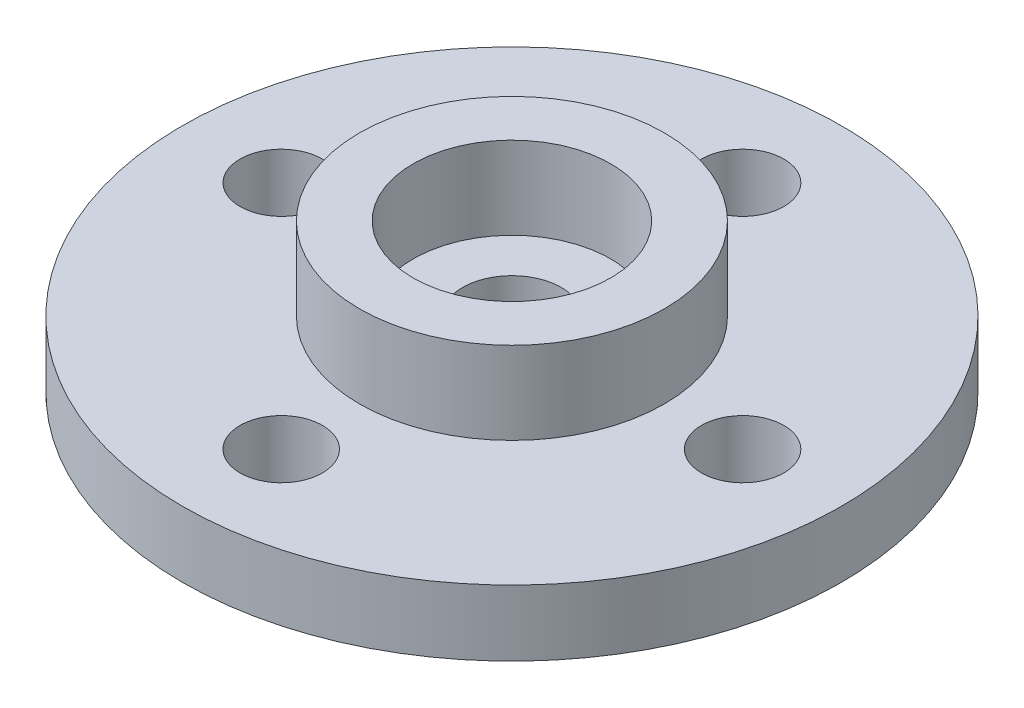
ISO-10303-21;
HEADER;
FILE_DESCRIPTION(('STEP AP214'),'2;1');
FILE_NAME('part.step','',(''),(''),'','','');
FILE_SCHEMA(('AUTOMOTIVE_DESIGN { 1 0 10303 214 1 1 1 1 }'));
ENDSEC;
DATA;
#1=APPLICATION_CONTEXT('core data for automotive mechanical design processes');
#2=APPLICATION_PROTOCOL_DEFINITION('international standard','automotive_design',2000,#1);
#3=PRODUCT_CONTEXT('',#1,'mechanical');
#4=PRODUCT('Part','Part','',(#3));
#5=PRODUCT_RELATED_PRODUCT_CATEGORY('part','',(#4));
#6=PRODUCT_DEFINITION_FORMATION('','',#4);
#7=PRODUCT_DEFINITION_CONTEXT('part definition',#1,'design');
#8=PRODUCT_DEFINITION('design','',#6,#7);
#9=PRODUCT_DEFINITION_SHAPE('','',#8);
#10=(LENGTH_UNIT() NAMED_UNIT(*) SI_UNIT(.MILLI.,.METRE.));
#11=(NAMED_UNIT(*) PLANE_ANGLE_UNIT() SI_UNIT($,.RADIAN.));
#12=(NAMED_UNIT(*) SI_UNIT($,.STERADIAN.) SOLID_ANGLE_UNIT());
#13=UNCERTAINTY_MEASURE_WITH_UNIT(LENGTH_MEASURE(1.E-05),#10,'distance_accuracy_value','');
#14=(GEOMETRIC_REPRESENTATION_CONTEXT(3) GLOBAL_UNCERTAINTY_ASSIGNED_CONTEXT((#13)) GLOBAL_UNIT_ASSIGNED_CONTEXT((#10,
#11,#12)) REPRESENTATION_CONTEXT('',''));
#15=CARTESIAN_POINT('',(0.,0.,0.));
#16=DIRECTION('',(0.,0.,1.));
#17=DIRECTION('',(1.,0.,0.));
#18=AXIS2_PLACEMENT_3D('',#15,#16,#17);
#19=CARTESIAN_POINT('',(0.,2.,0.));
#20=DIRECTION('',(0.,1.,0.));
#21=DIRECTION('',(0.,0.,1.));
#22=AXIS2_PLACEMENT_3D('',#19,#20,#21);
#23=PLANE('',#22);
#24=CARTESIAN_POINT('',(0.,2.,0.));
#25=DIRECTION('',(0.,1.,0.));
#26=DIRECTION('',(0.,0.,1.));
#27=AXIS2_PLACEMENT_3D('',#24,#25,#26);
#28=CIRCLE('',#27,1.5);
#29=CARTESIAN_POINT('',(0.,2.,1.5));
#30=VERTEX_POINT('',#29);
#31=EDGE_CURVE('E66',#30,#30,#28,.T.);
#32=ORIENTED_EDGE('',*,*,#31,.F.);
#33=EDGE_LOOP('',(#32));
#34=FACE_BOUND('',#33,.T.);
#35=CARTESIAN_POINT('',(0.,2.,0.));
#36=DIRECTION('',(0.,1.,0.));
#37=DIRECTION('',(0.,0.,1.));
#38=AXIS2_PLACEMENT_3D('',#35,#36,#37);
#39=CIRCLE('',#38,3.);
#40=CARTESIAN_POINT('',(0.,2.,3.));
#41=VERTEX_POINT('',#40);
#42=EDGE_CURVE('E204',#41,#41,#39,.T.);
#43=ORIENTED_EDGE('',*,*,#42,.T.);
#44=EDGE_LOOP('',(#43));
#45=FACE_BOUND('',#44,.T.);
#46=ADVANCED_FACE('F30',(#34,#45),#23,.T.);
#47=CARTESIAN_POINT('',(0.,2.,0.));
#48=DIRECTION('',(0.,1.,0.));
#49=DIRECTION('',(0.,0.,1.));
#50=AXIS2_PLACEMENT_3D('',#47,#48,#49);
#51=CIRCLE('',#50,4.625);
#52=CARTESIAN_POINT('',(0.,2.,4.625));
#53=VERTEX_POINT('',#52);
#54=EDGE_CURVE('E10',#53,#53,#51,.T.);
#55=ORIENTED_EDGE('',*,*,#54,.F.);
#56=EDGE_LOOP('',(#55));
#57=FACE_BOUND('',#56,.T.);
#58=CARTESIAN_POINT('',(3.95332173747447E-13,2.,7.));
#59=DIRECTION('',(0.,1.,0.));
#60=DIRECTION('',(0.,0.,1.));
#61=AXIS2_PLACEMENT_3D('',#58,#59,#60);
#62=CIRCLE('',#61,1.25000000000042);
#63=CARTESIAN_POINT('',(3.95332173747447E-13,2.,8.25000000000042));
#64=VERTEX_POINT('',#63);
#65=EDGE_CURVE('E54',#64,#64,#62,.T.);
#66=ORIENTED_EDGE('',*,*,#65,.F.);
#67=EDGE_LOOP('',(#66));
#68=FACE_BOUND('',#67,.T.);
#69=CARTESIAN_POINT('',(0.,2.,0.));
#70=DIRECTION('',(0.,1.,0.));
#71=DIRECTION('',(0.,0.,1.));
#72=AXIS2_PLACEMENT_3D('',#69,#70,#71);
#73=CIRCLE('',#72,10.);
#74=CARTESIAN_POINT('',(0.,2.,10.));
#75=VERTEX_POINT('',#74);
#76=EDGE_CURVE('E38',#75,#75,#73,.T.);
#77=ORIENTED_EDGE('',*,*,#76,.T.);
#78=EDGE_LOOP('',(#77));
#79=FACE_BOUND('',#78,.T.);
#80=CARTESIAN_POINT('',(0.,2.,-7.));
#81=DIRECTION('',(0.,1.,0.));
#82=DIRECTION('',(0.,0.,1.));
#83=AXIS2_PLACEMENT_3D('',#80,#81,#82);
#84=CIRCLE('',#83,1.25);
#85=CARTESIAN_POINT('',(0.,2.,-5.75));
#86=VERTEX_POINT('',#85);
#87=EDGE_CURVE('E72',#86,#86,#84,.T.);
#88=ORIENTED_EDGE('',*,*,#87,.F.);
#89=EDGE_LOOP('',(#88));
#90=FACE_BOUND('',#89,.T.);
#91=CARTESIAN_POINT('',(7.0000000000002,2.,-1.97666086873723E-13));
#92=DIRECTION('',(0.,1.,0.));
#93=DIRECTION('',(0.,0.,1.));
#94=AXIS2_PLACEMENT_3D('',#91,#92,#93);
#95=CIRCLE('',#94,1.25000000000015);
#96=CARTESIAN_POINT('',(7.0000000000002,2.,1.24999999999996));
#97=VERTEX_POINT('',#96);
#98=EDGE_CURVE('E60',#97,#97,#95,.T.);
#99=ORIENTED_EDGE('',*,*,#98,.F.);
#100=EDGE_LOOP('',(#99));
#101=FACE_BOUND('',#100,.T.);
#102=CARTESIAN_POINT('',(-6.9999999999998,2.,1.98523339633126E-13));
#103=DIRECTION('',(0.,1.,0.));
#104=DIRECTION('',(0.,0.,1.));
#105=AXIS2_PLACEMENT_3D('',#102,#103,#104);
#106=CIRCLE('',#105,1.25000000000032);
#107=CARTESIAN_POINT('',(-6.9999999999998,2.,1.25000000000052));
#108=VERTEX_POINT('',#107);
#109=EDGE_CURVE('E47',#108,#108,#106,.T.);
#110=ORIENTED_EDGE('',*,*,#109,.F.);
#111=EDGE_LOOP('',(#110));
#112=FACE_BOUND('',#111,.T.);
#113=ADVANCED_FACE('F96',(#57,#68,#79,#90,#101,#112),#23,.T.);
#114=CARTESIAN_POINT('',(0.,0.,0.));
#115=DIRECTION('',(0.,1.,0.));
#116=DIRECTION('',(0.,0.,1.));
#117=AXIS2_PLACEMENT_3D('',#114,#115,#116);
#118=PLANE('',#117);
#119=CARTESIAN_POINT('',(0.,0.,0.));
#120=DIRECTION('',(0.,1.,0.));
#121=DIRECTION('',(0.,0.,1.));
#122=AXIS2_PLACEMENT_3D('',#119,#120,#121);
#123=CIRCLE('',#122,10.);
#124=CARTESIAN_POINT('',(0.,0.,10.));
#125=VERTEX_POINT('',#124);
#126=EDGE_CURVE('E34',#125,#125,#123,.T.);
#127=ORIENTED_EDGE('',*,*,#126,.F.);
#128=EDGE_LOOP('',(#127));
#129=FACE_BOUND('',#128,.T.);
#130=CARTESIAN_POINT('',(0.,0.,-7.));
#131=DIRECTION('',(0.,1.,0.));
#132=DIRECTION('',(0.,0.,1.));
#133=AXIS2_PLACEMENT_3D('',#130,#131,#132);
#134=CIRCLE('',#133,1.25);
#135=CARTESIAN_POINT('',(0.,0.,-5.75));
#136=VERTEX_POINT('',#135);
#137=EDGE_CURVE('E69',#136,#136,#134,.T.);
#138=ORIENTED_EDGE('',*,*,#137,.T.);
#139=EDGE_LOOP('',(#138));
#140=FACE_BOUND('',#139,.T.);
#141=CARTESIAN_POINT('',(0.,0.,0.));
#142=DIRECTION('',(0.,1.,0.));
#143=DIRECTION('',(0.,0.,1.));
#144=AXIS2_PLACEMENT_3D('',#141,#142,#143);
#145=CIRCLE('',#144,1.5);
#146=CARTESIAN_POINT('',(0.,0.,1.5));
#147=VERTEX_POINT('',#146);
#148=EDGE_CURVE('E63',#147,#147,#145,.T.);
#149=ORIENTED_EDGE('',*,*,#148,.T.);
#150=EDGE_LOOP('',(#149));
#151=FACE_BOUND('',#150,.T.);
#152=CARTESIAN_POINT('',(7.0000000000002,0.,-1.97666086873723E-13));
#153=DIRECTION('',(0.,1.,0.));
#154=DIRECTION('',(0.,0.,1.));
#155=AXIS2_PLACEMENT_3D('',#152,#153,#154);
#156=CIRCLE('',#155,1.25000000000015);
#157=CARTESIAN_POINT('',(7.0000000000002,0.,1.24999999999996));
#158=VERTEX_POINT('',#157);
#159=EDGE_CURVE('E57',#158,#158,#156,.T.);
#160=ORIENTED_EDGE('',*,*,#159,.T.);
#161=EDGE_LOOP('',(#160));
#162=FACE_BOUND('',#161,.T.);
#163=CARTESIAN_POINT('',(3.95332173747447E-13,0.,7.));
#164=DIRECTION('',(0.,1.,0.));
#165=DIRECTION('',(0.,0.,1.));
#166=AXIS2_PLACEMENT_3D('',#163,#164,#165);
#167=CIRCLE('',#166,1.25000000000042);
#168=CARTESIAN_POINT('',(3.95332173747447E-13,0.,8.25000000000042));
#169=VERTEX_POINT('',#168);
#170=EDGE_CURVE('E50',#169,#169,#167,.T.);
#171=ORIENTED_EDGE('',*,*,#170,.T.);
#172=EDGE_LOOP('',(#171));
#173=FACE_BOUND('',#172,.T.);
#174=CARTESIAN_POINT('',(-6.9999999999998,0.,1.98523339633126E-13));
#175=DIRECTION('',(0.,1.,0.));
#176=DIRECTION('',(0.,0.,1.));
#177=AXIS2_PLACEMENT_3D('',#174,#175,#176);
#178=CIRCLE('',#177,1.25000000000032);
#179=CARTESIAN_POINT('',(-6.9999999999998,0.,1.25000000000052));
#180=VERTEX_POINT('',#179);
#181=EDGE_CURVE('E51',#180,#180,#178,.T.);
#182=ORIENTED_EDGE('',*,*,#181,.T.);
#183=EDGE_LOOP('',(#182));
#184=FACE_BOUND('',#183,.T.);
#185=ADVANCED_FACE('F78',(#129,#140,#151,#162,#173,#184),#118,.F.);
#186=CARTESIAN_POINT('',(0.,2.,0.));
#187=DIRECTION('',(0.,-1.,0.));
#188=DIRECTION('',(0.,0.,-1.));
#189=AXIS2_PLACEMENT_3D('',#186,#187,#188);
#190=CYLINDRICAL_SURFACE('',#189,10.);
#191=ORIENTED_EDGE('',*,*,#76,.F.);
#192=EDGE_LOOP('',(#191));
#193=FACE_BOUND('',#192,.T.);
#194=ORIENTED_EDGE('',*,*,#126,.T.);
#195=EDGE_LOOP('',(#194));
#196=FACE_BOUND('',#195,.T.);
#197=ADVANCED_FACE('F32',(#193,#196),#190,.T.);
#198=CARTESIAN_POINT('',(0.,2.,-7.));
#199=DIRECTION('',(0.,-1.,0.));
#200=DIRECTION('',(0.,0.,-1.));
#201=AXIS2_PLACEMENT_3D('',#198,#199,#200);
#202=CYLINDRICAL_SURFACE('',#201,1.25);
#203=ORIENTED_EDGE('',*,*,#87,.T.);
#204=EDGE_LOOP('',(#203));
#205=FACE_BOUND('',#204,.T.);
#206=ORIENTED_EDGE('',*,*,#137,.F.);
#207=EDGE_LOOP('',(#206));
#208=FACE_BOUND('',#207,.T.);
#209=ADVANCED_FACE('F81',(#205,#208),#202,.F.);
#210=CARTESIAN_POINT('',(0.,2.,0.));
#211=DIRECTION('',(0.,-1.,0.));
#212=DIRECTION('',(0.,0.,-1.));
#213=AXIS2_PLACEMENT_3D('',#210,#211,#212);
#214=CYLINDRICAL_SURFACE('',#213,1.5);
#215=ORIENTED_EDGE('',*,*,#31,.T.);
#216=EDGE_LOOP('',(#215));
#217=FACE_BOUND('',#216,.T.);
#218=ORIENTED_EDGE('',*,*,#148,.F.);
#219=EDGE_LOOP('',(#218));
#220=FACE_BOUND('',#219,.T.);
#221=ADVANCED_FACE('F83',(#217,#220),#214,.F.);
#222=CARTESIAN_POINT('',(7.0000000000002,2.,-1.97666086873723E-13));
#223=DIRECTION('',(0.,-1.,0.));
#224=DIRECTION('',(0.,0.,-1.));
#225=AXIS2_PLACEMENT_3D('',#222,#223,#224);
#226=CYLINDRICAL_SURFACE('',#225,1.25000000000015);
#227=ORIENTED_EDGE('',*,*,#98,.T.);
#228=EDGE_LOOP('',(#227));
#229=FACE_BOUND('',#228,.T.);
#230=ORIENTED_EDGE('',*,*,#159,.F.);
#231=EDGE_LOOP('',(#230));
#232=FACE_BOUND('',#231,.T.);
#233=ADVANCED_FACE('F90',(#229,#232),#226,.F.);
#234=CARTESIAN_POINT('',(3.95332173747447E-13,2.,7.));
#235=DIRECTION('',(0.,-1.,0.));
#236=DIRECTION('',(0.,0.,-1.));
#237=AXIS2_PLACEMENT_3D('',#234,#235,#236);
#238=CYLINDRICAL_SURFACE('',#237,1.25000000000042);
#239=ORIENTED_EDGE('',*,*,#65,.T.);
#240=EDGE_LOOP('',(#239));
#241=FACE_BOUND('',#240,.T.);
#242=ORIENTED_EDGE('',*,*,#170,.F.);
#243=EDGE_LOOP('',(#242));
#244=FACE_BOUND('',#243,.T.);
#245=ADVANCED_FACE('F136',(#241,#244),#238,.F.);
#246=CARTESIAN_POINT('',(-6.9999999999998,2.,1.98523339633126E-13));
#247=DIRECTION('',(0.,-1.,0.));
#248=DIRECTION('',(0.,0.,-1.));
#249=AXIS2_PLACEMENT_3D('',#246,#247,#248);
#250=CYLINDRICAL_SURFACE('',#249,1.25000000000032);
#251=ORIENTED_EDGE('',*,*,#109,.T.);
#252=EDGE_LOOP('',(#251));
#253=FACE_BOUND('',#252,.T.);
#254=ORIENTED_EDGE('',*,*,#181,.F.);
#255=EDGE_LOOP('',(#254));
#256=FACE_BOUND('',#255,.T.);
#257=ADVANCED_FACE('F146',(#253,#256),#250,.F.);
#258=CARTESIAN_POINT('',(0.,4.5,0.));
#259=DIRECTION('',(0.,1.,0.));
#260=DIRECTION('',(0.,0.,1.));
#261=AXIS2_PLACEMENT_3D('',#258,#259,#260);
#262=PLANE('',#261);
#263=CARTESIAN_POINT('',(0.,4.5,0.));
#264=DIRECTION('',(0.,1.,0.));
#265=DIRECTION('',(0.,0.,1.));
#266=AXIS2_PLACEMENT_3D('',#263,#264,#265);
#267=CIRCLE('',#266,4.625);
#268=CARTESIAN_POINT('',(0.,4.5,4.625));
#269=VERTEX_POINT('',#268);
#270=EDGE_CURVE('E45',#269,#269,#267,.T.);
#271=ORIENTED_EDGE('',*,*,#270,.T.);
#272=EDGE_LOOP('',(#271));
#273=FACE_BOUND('',#272,.T.);
#274=CARTESIAN_POINT('',(0.,4.5,0.));
#275=DIRECTION('',(0.,1.,0.));
#276=DIRECTION('',(0.,0.,1.));
#277=AXIS2_PLACEMENT_3D('',#274,#275,#276);
#278=CIRCLE('',#277,3.);
#279=CARTESIAN_POINT('',(0.,4.5,3.));
#280=VERTEX_POINT('',#279);
#281=EDGE_CURVE('E201',#280,#280,#278,.T.);
#282=ORIENTED_EDGE('',*,*,#281,.F.);
#283=EDGE_LOOP('',(#282));
#284=FACE_BOUND('',#283,.T.);
#285=ADVANCED_FACE('F155',(#273,#284),#262,.T.);
#286=CARTESIAN_POINT('',(0.,4.5,0.));
#287=DIRECTION('',(0.,-1.,0.));
#288=DIRECTION('',(0.,0.,-1.));
#289=AXIS2_PLACEMENT_3D('',#286,#287,#288);
#290=CYLINDRICAL_SURFACE('',#289,4.625);
#291=ORIENTED_EDGE('',*,*,#270,.F.);
#292=EDGE_LOOP('',(#291));
#293=FACE_BOUND('',#292,.T.);
#294=ORIENTED_EDGE('',*,*,#54,.T.);
#295=EDGE_LOOP('',(#294));
#296=FACE_BOUND('',#295,.T.);
#297=ADVANCED_FACE('F174',(#293,#296),#290,.T.);
#298=CARTESIAN_POINT('',(0.,4.5,0.));
#299=DIRECTION('',(0.,-1.,0.));
#300=DIRECTION('',(0.,0.,-1.));
#301=AXIS2_PLACEMENT_3D('',#298,#299,#300);
#302=CYLINDRICAL_SURFACE('',#301,3.);
#303=ORIENTED_EDGE('',*,*,#281,.T.);
#304=EDGE_LOOP('',(#303));
#305=FACE_BOUND('',#304,.T.);
#306=ORIENTED_EDGE('',*,*,#42,.F.);
#307=EDGE_LOOP('',(#306));
#308=FACE_BOUND('',#307,.T.);
#309=ADVANCED_FACE('F184',(#305,#308),#302,.F.);
#310=CLOSED_SHELL('',(#46,#113,#185,#197,#209,#221,#233,#245,#257,#285,#297,#309));
#311=MANIFOLD_SOLID_BREP('B2',#310);
#312=ADVANCED_BREP_SHAPE_REPRESENTATION('',(#18,#311),#14);
#313=SHAPE_DEFINITION_REPRESENTATION(#9,#312);
ENDSEC;
END-ISO-10303-21;
